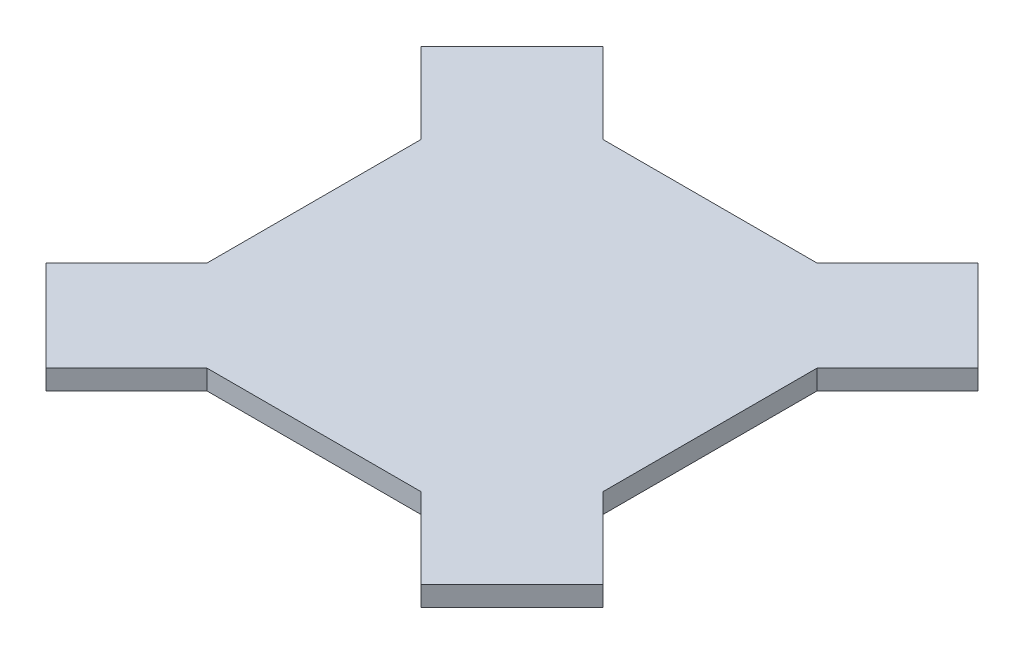
ISO-10303-21;
HEADER;
FILE_DESCRIPTION(('STEP AP214'),'2;1');
FILE_NAME('part.step','',(''),(''),'','','');
FILE_SCHEMA(('AUTOMOTIVE_DESIGN { 1 0 10303 214 1 1 1 1 }'));
ENDSEC;
DATA;
#1=APPLICATION_CONTEXT('core data for automotive mechanical design processes');
#2=APPLICATION_PROTOCOL_DEFINITION('international standard','automotive_design',2000,#1);
#3=PRODUCT_CONTEXT('',#1,'mechanical');
#4=PRODUCT('Part','Part','',(#3));
#5=PRODUCT_RELATED_PRODUCT_CATEGORY('part','',(#4));
#6=PRODUCT_DEFINITION_FORMATION('','',#4);
#7=PRODUCT_DEFINITION_CONTEXT('part definition',#1,'design');
#8=PRODUCT_DEFINITION('design','',#6,#7);
#9=PRODUCT_DEFINITION_SHAPE('','',#8);
#10=(LENGTH_UNIT() NAMED_UNIT(*) SI_UNIT(.MILLI.,.METRE.));
#11=(NAMED_UNIT(*) PLANE_ANGLE_UNIT() SI_UNIT($,.RADIAN.));
#12=(NAMED_UNIT(*) SI_UNIT($,.STERADIAN.) SOLID_ANGLE_UNIT());
#13=UNCERTAINTY_MEASURE_WITH_UNIT(LENGTH_MEASURE(1.E-05),#10,'distance_accuracy_value','');
#14=(GEOMETRIC_REPRESENTATION_CONTEXT(3) GLOBAL_UNCERTAINTY_ASSIGNED_CONTEXT((#13)) GLOBAL_UNIT_ASSIGNED_CONTEXT((#10,
#11,#12)) REPRESENTATION_CONTEXT('',''));
#15=CARTESIAN_POINT('',(0.,0.,0.));
#16=DIRECTION('',(0.,0.,1.));
#17=DIRECTION('',(1.,0.,0.));
#18=AXIS2_PLACEMENT_3D('',#15,#16,#17);
#19=CARTESIAN_POINT('',(-40.,4.,40.));
#20=DIRECTION('',(0.,0.,-1.));
#21=DIRECTION('',(-1.,0.,0.));
#22=AXIS2_PLACEMENT_3D('',#19,#20,#21);
#23=PLANE('',#22);
#24=DIRECTION('',(0.,1.,0.));
#25=VECTOR('',#24,1.);
#26=CARTESIAN_POINT('',(21.6152236891498,0.,40.));
#27=LINE('',#26,#25);
#28=CARTESIAN_POINT('',(21.6152236891498,0.,40.));
#29=VERTEX_POINT('',#28);
#30=CARTESIAN_POINT('',(21.6152236891498,4.,40.));
#31=VERTEX_POINT('',#30);
#32=EDGE_CURVE('E56',#29,#31,#27,.T.);
#33=ORIENTED_EDGE('',*,*,#32,.T.);
#34=DIRECTION('',(1.,0.,0.));
#35=VECTOR('',#34,1.);
#36=CARTESIAN_POINT('',(-40.,4.,40.));
#37=LINE('',#36,#35);
#38=CARTESIAN_POINT('',(-21.6152236891497,4.,40.));
#39=VERTEX_POINT('',#38);
#40=EDGE_CURVE('E11',#39,#31,#37,.T.);
#41=ORIENTED_EDGE('',*,*,#40,.F.);
#42=DIRECTION('',(0.,1.,0.));
#43=VECTOR('',#42,1.);
#44=CARTESIAN_POINT('',(-21.6152236891497,0.,40.));
#45=LINE('',#44,#43);
#46=CARTESIAN_POINT('',(-21.6152236891497,0.,40.));
#47=VERTEX_POINT('',#46);
#48=EDGE_CURVE('E236',#47,#39,#45,.T.);
#49=ORIENTED_EDGE('',*,*,#48,.F.);
#50=DIRECTION('',(1.,0.,0.));
#51=VECTOR('',#50,1.);
#52=CARTESIAN_POINT('',(-40.,0.,40.));
#53=LINE('',#52,#51);
#54=EDGE_CURVE('E43',#47,#29,#53,.T.);
#55=ORIENTED_EDGE('',*,*,#54,.T.);
#56=EDGE_LOOP('',(#33,#41,#49,#55));
#57=FACE_BOUND('',#56,.T.);
#58=ADVANCED_FACE('F39',(#57),#23,.F.);
#59=CARTESIAN_POINT('',(-40.,4.,-40.));
#60=DIRECTION('',(0.,0.,1.));
#61=DIRECTION('',(1.,0.,0.));
#62=AXIS2_PLACEMENT_3D('',#59,#60,#61);
#63=PLANE('',#62);
#64=DIRECTION('',(0.,1.,0.));
#65=VECTOR('',#64,1.);
#66=CARTESIAN_POINT('',(21.6152236891498,0.,-40.));
#67=LINE('',#66,#65);
#68=CARTESIAN_POINT('',(21.6152236891498,0.,-40.));
#69=VERTEX_POINT('',#68);
#70=CARTESIAN_POINT('',(21.6152236891498,4.,-40.));
#71=VERTEX_POINT('',#70);
#72=EDGE_CURVE('E200',#69,#71,#67,.T.);
#73=ORIENTED_EDGE('',*,*,#72,.F.);
#74=DIRECTION('',(-1.,0.,0.));
#75=VECTOR('',#74,1.);
#76=CARTESIAN_POINT('',(-40.,0.,-40.));
#77=LINE('',#76,#75);
#78=CARTESIAN_POINT('',(-21.6152236891497,0.,-40.));
#79=VERTEX_POINT('',#78);
#80=EDGE_CURVE('E274',#69,#79,#77,.T.);
#81=ORIENTED_EDGE('',*,*,#80,.T.);
#82=DIRECTION('',(0.,1.,0.));
#83=VECTOR('',#82,1.);
#84=CARTESIAN_POINT('',(-21.6152236891497,0.,-40.));
#85=LINE('',#84,#83);
#86=CARTESIAN_POINT('',(-21.6152236891497,4.,-40.));
#87=VERTEX_POINT('',#86);
#88=EDGE_CURVE('E251',#79,#87,#85,.T.);
#89=ORIENTED_EDGE('',*,*,#88,.T.);
#90=DIRECTION('',(-1.,0.,0.));
#91=VECTOR('',#90,1.);
#92=CARTESIAN_POINT('',(-40.,4.,-40.));
#93=LINE('',#92,#91);
#94=EDGE_CURVE('E269',#71,#87,#93,.T.);
#95=ORIENTED_EDGE('',*,*,#94,.F.);
#96=EDGE_LOOP('',(#73,#81,#89,#95));
#97=FACE_BOUND('',#96,.T.);
#98=ADVANCED_FACE('F316',(#97),#63,.F.);
#99=CARTESIAN_POINT('',(-40.,4.,40.));
#100=DIRECTION('',(1.,0.,0.));
#101=DIRECTION('',(0.,0.,-1.));
#102=AXIS2_PLACEMENT_3D('',#99,#100,#101);
#103=PLANE('',#102);
#104=DIRECTION('',(0.,1.,0.));
#105=VECTOR('',#104,1.);
#106=CARTESIAN_POINT('',(-40.,0.,21.6152236891499));
#107=LINE('',#106,#105);
#108=CARTESIAN_POINT('',(-40.,0.,21.6152236891499));
#109=VERTEX_POINT('',#108);
#110=CARTESIAN_POINT('',(-40.,4.,21.6152236891499));
#111=VERTEX_POINT('',#110);
#112=EDGE_CURVE('E233',#109,#111,#107,.T.);
#113=ORIENTED_EDGE('',*,*,#112,.T.);
#114=DIRECTION('',(0.,0.,1.));
#115=VECTOR('',#114,1.);
#116=CARTESIAN_POINT('',(-40.,4.,40.));
#117=LINE('',#116,#115);
#118=CARTESIAN_POINT('',(-40.,4.,-21.6152236891498));
#119=VERTEX_POINT('',#118);
#120=EDGE_CURVE('E48',#119,#111,#117,.T.);
#121=ORIENTED_EDGE('',*,*,#120,.F.);
#122=DIRECTION('',(0.,1.,0.));
#123=VECTOR('',#122,1.);
#124=CARTESIAN_POINT('',(-40.,0.,-21.6152236891498));
#125=LINE('',#124,#123);
#126=CARTESIAN_POINT('',(-40.,0.,-21.6152236891498));
#127=VERTEX_POINT('',#126);
#128=EDGE_CURVE('E258',#127,#119,#125,.T.);
#129=ORIENTED_EDGE('',*,*,#128,.F.);
#130=DIRECTION('',(0.,0.,1.));
#131=VECTOR('',#130,1.);
#132=CARTESIAN_POINT('',(-40.,0.,40.));
#133=LINE('',#132,#131);
#134=EDGE_CURVE('E275',#127,#109,#133,.T.);
#135=ORIENTED_EDGE('',*,*,#134,.T.);
#136=EDGE_LOOP('',(#113,#121,#129,#135));
#137=FACE_BOUND('',#136,.T.);
#138=ADVANCED_FACE('F298',(#137),#103,.F.);
#139=CARTESIAN_POINT('',(40.,4.,40.));
#140=DIRECTION('',(-1.,0.,0.));
#141=DIRECTION('',(0.,0.,1.));
#142=AXIS2_PLACEMENT_3D('',#139,#140,#141);
#143=PLANE('',#142);
#144=DIRECTION('',(0.,0.,-1.));
#145=VECTOR('',#144,1.);
#146=CARTESIAN_POINT('',(40.,4.,40.));
#147=LINE('',#146,#145);
#148=CARTESIAN_POINT('',(40.,4.,21.6152236891497));
#149=VERTEX_POINT('',#148);
#150=CARTESIAN_POINT('',(40.,4.,-21.6152236891497));
#151=VERTEX_POINT('',#150);
#152=EDGE_CURVE('E63',#149,#151,#147,.T.);
#153=ORIENTED_EDGE('',*,*,#152,.F.);
#154=DIRECTION('',(0.,1.,0.));
#155=VECTOR('',#154,1.);
#156=CARTESIAN_POINT('',(40.,0.,21.6152236891497));
#157=LINE('',#156,#155);
#158=CARTESIAN_POINT('',(40.,0.,21.6152236891497));
#159=VERTEX_POINT('',#158);
#160=EDGE_CURVE('E164',#159,#149,#157,.T.);
#161=ORIENTED_EDGE('',*,*,#160,.F.);
#162=DIRECTION('',(0.,0.,-1.));
#163=VECTOR('',#162,1.);
#164=CARTESIAN_POINT('',(40.,0.,40.));
#165=LINE('',#164,#163);
#166=CARTESIAN_POINT('',(40.,0.,-21.6152236891497));
#167=VERTEX_POINT('',#166);
#168=EDGE_CURVE('E173',#159,#167,#165,.T.);
#169=ORIENTED_EDGE('',*,*,#168,.T.);
#170=DIRECTION('',(0.,1.,0.));
#171=VECTOR('',#170,1.);
#172=CARTESIAN_POINT('',(40.,0.,-21.6152236891497));
#173=LINE('',#172,#171);
#174=EDGE_CURVE('E213',#167,#151,#173,.T.);
#175=ORIENTED_EDGE('',*,*,#174,.T.);
#176=EDGE_LOOP('',(#153,#161,#169,#175));
#177=FACE_BOUND('',#176,.T.);
#178=ADVANCED_FACE('F41',(#177),#143,.F.);
#179=CARTESIAN_POINT('',(0.,4.,0.));
#180=DIRECTION('',(0.,-1.,0.));
#181=DIRECTION('',(0.,0.,-1.));
#182=AXIS2_PLACEMENT_3D('',#179,#180,#181);
#183=PLANE('',#182);
#184=ORIENTED_EDGE('',*,*,#40,.T.);
#185=DIRECTION('',(-0.707106781186548,0.,-0.707106781186547));
#186=VECTOR('',#185,1.);
#187=CARTESIAN_POINT('',(-9.19238815542509,4.,9.1923881554251));
#188=LINE('',#187,#186);
#189=CARTESIAN_POINT('',(37.8786796564404,4.,56.2634559672906));
#190=VERTEX_POINT('',#189);
#191=EDGE_CURVE('E178',#190,#31,#188,.T.);
#192=ORIENTED_EDGE('',*,*,#191,.F.);
#193=DIRECTION('',(0.707106781186547,0.,-0.707106781186548));
#194=VECTOR('',#193,1.);
#195=CARTESIAN_POINT('',(47.0710678118655,4.,47.0710678118655));
#196=LINE('',#195,#194);
#197=CARTESIAN_POINT('',(56.2634559672906,4.,37.8786796564403));
#198=VERTEX_POINT('',#197);
#199=EDGE_CURVE('E184',#190,#198,#196,.T.);
#200=ORIENTED_EDGE('',*,*,#199,.T.);
#201=DIRECTION('',(-0.707106781186548,0.,-0.707106781186547));
#202=VECTOR('',#201,1.);
#203=CARTESIAN_POINT('',(9.19238815542514,4.,-9.19238815542514));
#204=LINE('',#203,#202);
#205=EDGE_CURVE('E159',#198,#149,#204,.T.);
#206=ORIENTED_EDGE('',*,*,#205,.T.);
#207=ORIENTED_EDGE('',*,*,#152,.T.);
#208=DIRECTION('',(0.707106781186548,0.,-0.707106781186547));
#209=VECTOR('',#208,1.);
#210=CARTESIAN_POINT('',(9.19238815542516,4.,9.19238815542516));
#211=LINE('',#210,#209);
#212=CARTESIAN_POINT('',(56.2634559672906,4.,-37.8786796564403));
#213=VERTEX_POINT('',#212);
#214=EDGE_CURVE('E203',#151,#213,#211,.T.);
#215=ORIENTED_EDGE('',*,*,#214,.T.);
#216=DIRECTION('',(-0.707106781186548,0.,-0.707106781186547));
#217=VECTOR('',#216,1.);
#218=CARTESIAN_POINT('',(47.0710678118655,4.,-47.0710678118655));
#219=LINE('',#218,#217);
#220=CARTESIAN_POINT('',(37.8786796564404,4.,-56.2634559672905));
#221=VERTEX_POINT('',#220);
#222=EDGE_CURVE('E194',#213,#221,#219,.T.);
#223=ORIENTED_EDGE('',*,*,#222,.T.);
#224=DIRECTION('',(0.707106781186547,0.,-0.707106781186548));
#225=VECTOR('',#224,1.);
#226=CARTESIAN_POINT('',(-9.19238815542507,4.,-9.19238815542507));
#227=LINE('',#226,#225);
#228=EDGE_CURVE('E188',#71,#221,#227,.T.);
#229=ORIENTED_EDGE('',*,*,#228,.F.);
#230=ORIENTED_EDGE('',*,*,#94,.T.);
#231=DIRECTION('',(-0.707106781186548,0.,-0.707106781186547));
#232=VECTOR('',#231,1.);
#233=CARTESIAN_POINT('',(9.19238815542514,4.,-9.19238815542514));
#234=LINE('',#233,#232);
#235=CARTESIAN_POINT('',(-37.8786796564404,4.,-56.2634559672906));
#236=VERTEX_POINT('',#235);
#237=EDGE_CURVE('E235',#87,#236,#234,.T.);
#238=ORIENTED_EDGE('',*,*,#237,.T.);
#239=DIRECTION('',(0.707106781186548,0.,-0.707106781186548));
#240=VECTOR('',#239,1.);
#241=CARTESIAN_POINT('',(-47.0710678118655,4.,-47.0710678118655));
#242=LINE('',#241,#240);
#243=CARTESIAN_POINT('',(-56.2634559672906,4.,-37.8786796564404));
#244=VERTEX_POINT('',#243);
#245=EDGE_CURVE('E254',#244,#236,#242,.T.);
#246=ORIENTED_EDGE('',*,*,#245,.F.);
#247=DIRECTION('',(-0.707106781186548,0.,-0.707106781186547));
#248=VECTOR('',#247,1.);
#249=CARTESIAN_POINT('',(-9.19238815542509,4.,9.1923881554251));
#250=LINE('',#249,#248);
#251=EDGE_CURVE('E247',#119,#244,#250,.T.);
#252=ORIENTED_EDGE('',*,*,#251,.F.);
#253=ORIENTED_EDGE('',*,*,#120,.T.);
#254=DIRECTION('',(0.707106781186547,0.,-0.707106781186548));
#255=VECTOR('',#254,1.);
#256=CARTESIAN_POINT('',(-9.19238815542507,4.,-9.19238815542507));
#257=LINE('',#256,#255);
#258=CARTESIAN_POINT('',(-56.2634559672905,4.,37.8786796564404));
#259=VERTEX_POINT('',#258);
#260=EDGE_CURVE('E210',#259,#111,#257,.T.);
#261=ORIENTED_EDGE('',*,*,#260,.F.);
#262=DIRECTION('',(-0.707106781186548,0.,-0.707106781186547));
#263=VECTOR('',#262,1.);
#264=CARTESIAN_POINT('',(-47.0710678118655,4.,47.0710678118655));
#265=LINE('',#264,#263);
#266=CARTESIAN_POINT('',(-37.8786796564403,4.,56.2634559672906));
#267=VERTEX_POINT('',#266);
#268=EDGE_CURVE('E229',#267,#259,#265,.T.);
#269=ORIENTED_EDGE('',*,*,#268,.F.);
#270=DIRECTION('',(0.707106781186548,0.,-0.707106781186547));
#271=VECTOR('',#270,1.);
#272=CARTESIAN_POINT('',(9.19238815542516,4.,9.19238815542516));
#273=LINE('',#272,#271);
#274=EDGE_CURVE('E221',#267,#39,#273,.T.);
#275=ORIENTED_EDGE('',*,*,#274,.T.);
#276=EDGE_LOOP('',(#184,#192,#200,#206,#207,#215,#223,#229,#230,#238,#246,#252,#253,#261,#269,#275));
#277=FACE_BOUND('',#276,.T.);
#278=ADVANCED_FACE('F284',(#277),#183,.F.);
#279=CARTESIAN_POINT('',(0.,0.,0.));
#280=DIRECTION('',(0.,-1.,0.));
#281=DIRECTION('',(0.,0.,-1.));
#282=AXIS2_PLACEMENT_3D('',#279,#280,#281);
#283=PLANE('',#282);
#284=ORIENTED_EDGE('',*,*,#168,.F.);
#285=DIRECTION('',(-0.707106781186548,0.,-0.707106781186547));
#286=VECTOR('',#285,1.);
#287=CARTESIAN_POINT('',(9.19238815542514,0.,-9.19238815542514));
#288=LINE('',#287,#286);
#289=CARTESIAN_POINT('',(56.2634559672906,0.,37.8786796564403));
#290=VERTEX_POINT('',#289);
#291=EDGE_CURVE('E157',#290,#159,#288,.T.);
#292=ORIENTED_EDGE('',*,*,#291,.F.);
#293=DIRECTION('',(0.707106781186547,0.,-0.707106781186548));
#294=VECTOR('',#293,1.);
#295=CARTESIAN_POINT('',(47.0710678118655,0.,47.0710678118655));
#296=LINE('',#295,#294);
#297=CARTESIAN_POINT('',(37.8786796564404,0.,56.2634559672906));
#298=VERTEX_POINT('',#297);
#299=EDGE_CURVE('E171',#298,#290,#296,.T.);
#300=ORIENTED_EDGE('',*,*,#299,.F.);
#301=DIRECTION('',(-0.707106781186548,0.,-0.707106781186547));
#302=VECTOR('',#301,1.);
#303=CARTESIAN_POINT('',(-9.19238815542509,0.,9.1923881554251));
#304=LINE('',#303,#302);
#305=EDGE_CURVE('E165',#298,#29,#304,.T.);
#306=ORIENTED_EDGE('',*,*,#305,.T.);
#307=ORIENTED_EDGE('',*,*,#54,.F.);
#308=DIRECTION('',(0.707106781186548,0.,-0.707106781186547));
#309=VECTOR('',#308,1.);
#310=CARTESIAN_POINT('',(9.19238815542516,0.,9.19238815542516));
#311=LINE('',#310,#309);
#312=CARTESIAN_POINT('',(-37.8786796564403,0.,56.2634559672906));
#313=VERTEX_POINT('',#312);
#314=EDGE_CURVE('E223',#313,#47,#311,.T.);
#315=ORIENTED_EDGE('',*,*,#314,.F.);
#316=DIRECTION('',(-0.707106781186548,0.,-0.707106781186547));
#317=VECTOR('',#316,1.);
#318=CARTESIAN_POINT('',(-47.0710678118655,0.,47.0710678118655));
#319=LINE('',#318,#317);
#320=CARTESIAN_POINT('',(-56.2634559672905,0.,37.8786796564404));
#321=VERTEX_POINT('',#320);
#322=EDGE_CURVE('E220',#313,#321,#319,.T.);
#323=ORIENTED_EDGE('',*,*,#322,.T.);
#324=DIRECTION('',(0.707106781186547,0.,-0.707106781186548));
#325=VECTOR('',#324,1.);
#326=CARTESIAN_POINT('',(-9.19238815542507,0.,-9.19238815542507));
#327=LINE('',#326,#325);
#328=EDGE_CURVE('E217',#321,#109,#327,.T.);
#329=ORIENTED_EDGE('',*,*,#328,.T.);
#330=ORIENTED_EDGE('',*,*,#134,.F.);
#331=DIRECTION('',(-0.707106781186548,0.,-0.707106781186547));
#332=VECTOR('',#331,1.);
#333=CARTESIAN_POINT('',(-9.19238815542509,0.,9.1923881554251));
#334=LINE('',#333,#332);
#335=CARTESIAN_POINT('',(-56.2634559672906,0.,-37.8786796564404));
#336=VERTEX_POINT('',#335);
#337=EDGE_CURVE('E249',#127,#336,#334,.T.);
#338=ORIENTED_EDGE('',*,*,#337,.T.);
#339=DIRECTION('',(0.707106781186548,0.,-0.707106781186548));
#340=VECTOR('',#339,1.);
#341=CARTESIAN_POINT('',(-47.0710678118655,0.,-47.0710678118655));
#342=LINE('',#341,#340);
#343=CARTESIAN_POINT('',(-37.8786796564404,0.,-56.2634559672906));
#344=VERTEX_POINT('',#343);
#345=EDGE_CURVE('E246',#336,#344,#342,.T.);
#346=ORIENTED_EDGE('',*,*,#345,.T.);
#347=DIRECTION('',(-0.707106781186548,0.,-0.707106781186547));
#348=VECTOR('',#347,1.);
#349=CARTESIAN_POINT('',(9.19238815542514,0.,-9.19238815542514));
#350=LINE('',#349,#348);
#351=EDGE_CURVE('E243',#79,#344,#350,.T.);
#352=ORIENTED_EDGE('',*,*,#351,.F.);
#353=ORIENTED_EDGE('',*,*,#80,.F.);
#354=DIRECTION('',(0.707106781186547,0.,-0.707106781186548));
#355=VECTOR('',#354,1.);
#356=CARTESIAN_POINT('',(-9.19238815542507,0.,-9.19238815542507));
#357=LINE('',#356,#355);
#358=CARTESIAN_POINT('',(37.8786796564404,0.,-56.2634559672905));
#359=VERTEX_POINT('',#358);
#360=EDGE_CURVE('E191',#69,#359,#357,.T.);
#361=ORIENTED_EDGE('',*,*,#360,.T.);
#362=DIRECTION('',(-0.707106781186548,0.,-0.707106781186547));
#363=VECTOR('',#362,1.);
#364=CARTESIAN_POINT('',(47.0710678118655,0.,-47.0710678118655));
#365=LINE('',#364,#363);
#366=CARTESIAN_POINT('',(56.2634559672906,0.,-37.8786796564403));
#367=VERTEX_POINT('',#366);
#368=EDGE_CURVE('E197',#367,#359,#365,.T.);
#369=ORIENTED_EDGE('',*,*,#368,.F.);
#370=DIRECTION('',(0.707106781186548,0.,-0.707106781186547));
#371=VECTOR('',#370,1.);
#372=CARTESIAN_POINT('',(9.19238815542516,0.,9.19238815542516));
#373=LINE('',#372,#371);
#374=EDGE_CURVE('E193',#167,#367,#373,.T.);
#375=ORIENTED_EDGE('',*,*,#374,.F.);
#376=EDGE_LOOP('',(#284,#292,#300,#306,#307,#315,#323,#329,#330,#338,#346,#352,#353,#361,#369,#375));
#377=FACE_BOUND('',#376,.T.);
#378=ADVANCED_FACE('F169',(#377),#283,.T.);
#379=CARTESIAN_POINT('',(-9.19238815542509,0.,9.1923881554251));
#380=DIRECTION('',(0.707106781186547,0.,-0.707106781186548));
#381=DIRECTION('',(-0.707106781186548,0.,-0.707106781186547));
#382=AXIS2_PLACEMENT_3D('',#379,#380,#381);
#383=PLANE('',#382);
#384=ORIENTED_EDGE('',*,*,#251,.T.);
#385=DIRECTION('',(0.,1.,0.));
#386=VECTOR('',#385,1.);
#387=CARTESIAN_POINT('',(-56.2634559672906,0.,-37.8786796564404));
#388=LINE('',#387,#386);
#389=EDGE_CURVE('E261',#336,#244,#388,.T.);
#390=ORIENTED_EDGE('',*,*,#389,.F.);
#391=ORIENTED_EDGE('',*,*,#337,.F.);
#392=ORIENTED_EDGE('',*,*,#128,.T.);
#393=EDGE_LOOP('',(#384,#390,#391,#392));
#394=FACE_BOUND('',#393,.T.);
#395=ADVANCED_FACE('F303',(#394),#383,.F.);
#396=CARTESIAN_POINT('',(-47.0710678118655,0.,-47.0710678118655));
#397=DIRECTION('',(0.707106781186547,0.,0.707106781186547));
#398=DIRECTION('',(0.707106781186548,0.,-0.707106781186548));
#399=AXIS2_PLACEMENT_3D('',#396,#397,#398);
#400=PLANE('',#399);
#401=ORIENTED_EDGE('',*,*,#245,.T.);
#402=DIRECTION('',(0.,1.,0.));
#403=VECTOR('',#402,1.);
#404=CARTESIAN_POINT('',(-37.8786796564404,0.,-56.2634559672906));
#405=LINE('',#404,#403);
#406=EDGE_CURVE('E264',#344,#236,#405,.T.);
#407=ORIENTED_EDGE('',*,*,#406,.F.);
#408=ORIENTED_EDGE('',*,*,#345,.F.);
#409=ORIENTED_EDGE('',*,*,#389,.T.);
#410=EDGE_LOOP('',(#401,#407,#408,#409));
#411=FACE_BOUND('',#410,.T.);
#412=ADVANCED_FACE('F307',(#411),#400,.F.);
#413=CARTESIAN_POINT('',(9.19238815542514,0.,-9.19238815542514));
#414=DIRECTION('',(0.707106781186547,0.,-0.707106781186548));
#415=DIRECTION('',(-0.707106781186548,0.,-0.707106781186547));
#416=AXIS2_PLACEMENT_3D('',#413,#414,#415);
#417=PLANE('',#416);
#418=ORIENTED_EDGE('',*,*,#237,.F.);
#419=ORIENTED_EDGE('',*,*,#88,.F.);
#420=ORIENTED_EDGE('',*,*,#351,.T.);
#421=ORIENTED_EDGE('',*,*,#406,.T.);
#422=EDGE_LOOP('',(#418,#419,#420,#421));
#423=FACE_BOUND('',#422,.T.);
#424=ADVANCED_FACE('F314',(#423),#417,.T.);
#425=CARTESIAN_POINT('',(-9.19238815542507,0.,-9.19238815542507));
#426=DIRECTION('',(0.707106781186548,0.,0.707106781186547));
#427=DIRECTION('',(0.707106781186547,0.,-0.707106781186548));
#428=AXIS2_PLACEMENT_3D('',#425,#426,#427);
#429=PLANE('',#428);
#430=ORIENTED_EDGE('',*,*,#260,.T.);
#431=ORIENTED_EDGE('',*,*,#112,.F.);
#432=ORIENTED_EDGE('',*,*,#328,.F.);
#433=DIRECTION('',(0.,1.,0.));
#434=VECTOR('',#433,1.);
#435=CARTESIAN_POINT('',(-56.2634559672905,0.,37.8786796564404));
#436=LINE('',#435,#434);
#437=EDGE_CURVE('E226',#321,#259,#436,.T.);
#438=ORIENTED_EDGE('',*,*,#437,.T.);
#439=EDGE_LOOP('',(#430,#431,#432,#438));
#440=FACE_BOUND('',#439,.T.);
#441=ADVANCED_FACE('F297',(#440),#429,.F.);
#442=CARTESIAN_POINT('',(9.19238815542516,0.,9.19238815542516));
#443=DIRECTION('',(0.707106781186547,0.,0.707106781186548));
#444=DIRECTION('',(0.707106781186548,0.,-0.707106781186547));
#445=AXIS2_PLACEMENT_3D('',#442,#443,#444);
#446=PLANE('',#445);
#447=ORIENTED_EDGE('',*,*,#274,.F.);
#448=DIRECTION('',(0.,1.,0.));
#449=VECTOR('',#448,1.);
#450=CARTESIAN_POINT('',(-37.8786796564403,0.,56.2634559672906));
#451=LINE('',#450,#449);
#452=EDGE_CURVE('E239',#313,#267,#451,.T.);
#453=ORIENTED_EDGE('',*,*,#452,.F.);
#454=ORIENTED_EDGE('',*,*,#314,.T.);
#455=ORIENTED_EDGE('',*,*,#48,.T.);
#456=EDGE_LOOP('',(#447,#453,#454,#455));
#457=FACE_BOUND('',#456,.T.);
#458=ADVANCED_FACE('F288',(#457),#446,.T.);
#459=CARTESIAN_POINT('',(-47.0710678118655,0.,47.0710678118655));
#460=DIRECTION('',(0.707106781186547,0.,-0.707106781186548));
#461=DIRECTION('',(-0.707106781186548,0.,-0.707106781186547));
#462=AXIS2_PLACEMENT_3D('',#459,#460,#461);
#463=PLANE('',#462);
#464=ORIENTED_EDGE('',*,*,#268,.T.);
#465=ORIENTED_EDGE('',*,*,#437,.F.);
#466=ORIENTED_EDGE('',*,*,#322,.F.);
#467=ORIENTED_EDGE('',*,*,#452,.T.);
#468=EDGE_LOOP('',(#464,#465,#466,#467));
#469=FACE_BOUND('',#468,.T.);
#470=ADVANCED_FACE('F294',(#469),#463,.F.);
#471=CARTESIAN_POINT('',(-9.19238815542507,0.,-9.19238815542507));
#472=DIRECTION('',(0.707106781186548,0.,0.707106781186547));
#473=DIRECTION('',(0.707106781186547,0.,-0.707106781186548));
#474=AXIS2_PLACEMENT_3D('',#471,#472,#473);
#475=PLANE('',#474);
#476=ORIENTED_EDGE('',*,*,#228,.T.);
#477=DIRECTION('',(0.,1.,0.));
#478=VECTOR('',#477,1.);
#479=CARTESIAN_POINT('',(37.8786796564404,0.,-56.2634559672905));
#480=LINE('',#479,#478);
#481=EDGE_CURVE('E208',#359,#221,#480,.T.);
#482=ORIENTED_EDGE('',*,*,#481,.F.);
#483=ORIENTED_EDGE('',*,*,#360,.F.);
#484=ORIENTED_EDGE('',*,*,#72,.T.);
#485=EDGE_LOOP('',(#476,#482,#483,#484));
#486=FACE_BOUND('',#485,.T.);
#487=ADVANCED_FACE('F321',(#486),#475,.F.);
#488=CARTESIAN_POINT('',(47.0710678118655,0.,-47.0710678118655));
#489=DIRECTION('',(0.707106781186547,0.,-0.707106781186548));
#490=DIRECTION('',(-0.707106781186548,0.,-0.707106781186547));
#491=AXIS2_PLACEMENT_3D('',#488,#489,#490);
#492=PLANE('',#491);
#493=ORIENTED_EDGE('',*,*,#222,.F.);
#494=DIRECTION('',(0.,1.,0.));
#495=VECTOR('',#494,1.);
#496=CARTESIAN_POINT('',(56.2634559672906,0.,-37.8786796564403));
#497=LINE('',#496,#495);
#498=EDGE_CURVE('E211',#367,#213,#497,.T.);
#499=ORIENTED_EDGE('',*,*,#498,.F.);
#500=ORIENTED_EDGE('',*,*,#368,.T.);
#501=ORIENTED_EDGE('',*,*,#481,.T.);
#502=EDGE_LOOP('',(#493,#499,#500,#501));
#503=FACE_BOUND('',#502,.T.);
#504=ADVANCED_FACE('F325',(#503),#492,.T.);
#505=CARTESIAN_POINT('',(9.19238815542516,0.,9.19238815542516));
#506=DIRECTION('',(0.707106781186547,0.,0.707106781186548));
#507=DIRECTION('',(0.707106781186548,0.,-0.707106781186547));
#508=AXIS2_PLACEMENT_3D('',#505,#506,#507);
#509=PLANE('',#508);
#510=ORIENTED_EDGE('',*,*,#214,.F.);
#511=ORIENTED_EDGE('',*,*,#174,.F.);
#512=ORIENTED_EDGE('',*,*,#374,.T.);
#513=ORIENTED_EDGE('',*,*,#498,.T.);
#514=EDGE_LOOP('',(#510,#511,#512,#513));
#515=FACE_BOUND('',#514,.T.);
#516=ADVANCED_FACE('F329',(#515),#509,.T.);
#517=CARTESIAN_POINT('',(47.0710678118655,0.,47.0710678118655));
#518=DIRECTION('',(0.707106781186548,0.,0.707106781186547));
#519=DIRECTION('',(0.707106781186547,0.,-0.707106781186548));
#520=AXIS2_PLACEMENT_3D('',#517,#518,#519);
#521=PLANE('',#520);
#522=ORIENTED_EDGE('',*,*,#199,.F.);
#523=DIRECTION('',(0.,1.,0.));
#524=VECTOR('',#523,1.);
#525=CARTESIAN_POINT('',(37.8786796564404,0.,56.2634559672906));
#526=LINE('',#525,#524);
#527=EDGE_CURVE('E176',#298,#190,#526,.T.);
#528=ORIENTED_EDGE('',*,*,#527,.F.);
#529=ORIENTED_EDGE('',*,*,#299,.T.);
#530=DIRECTION('',(0.,1.,0.));
#531=VECTOR('',#530,1.);
#532=CARTESIAN_POINT('',(56.2634559672906,0.,37.8786796564403));
#533=LINE('',#532,#531);
#534=EDGE_CURVE('E154',#290,#198,#533,.T.);
#535=ORIENTED_EDGE('',*,*,#534,.T.);
#536=EDGE_LOOP('',(#522,#528,#529,#535));
#537=FACE_BOUND('',#536,.T.);
#538=ADVANCED_FACE('F175',(#537),#521,.T.);
#539=CARTESIAN_POINT('',(-9.19238815542509,0.,9.1923881554251));
#540=DIRECTION('',(0.707106781186547,0.,-0.707106781186548));
#541=DIRECTION('',(-0.707106781186548,0.,-0.707106781186547));
#542=AXIS2_PLACEMENT_3D('',#539,#540,#541);
#543=PLANE('',#542);
#544=ORIENTED_EDGE('',*,*,#191,.T.);
#545=ORIENTED_EDGE('',*,*,#32,.F.);
#546=ORIENTED_EDGE('',*,*,#305,.F.);
#547=ORIENTED_EDGE('',*,*,#527,.T.);
#548=EDGE_LOOP('',(#544,#545,#546,#547));
#549=FACE_BOUND('',#548,.T.);
#550=ADVANCED_FACE('F281',(#549),#543,.F.);
#551=CARTESIAN_POINT('',(9.19238815542514,0.,-9.19238815542514));
#552=DIRECTION('',(0.707106781186547,0.,-0.707106781186548));
#553=DIRECTION('',(-0.707106781186548,0.,-0.707106781186547));
#554=AXIS2_PLACEMENT_3D('',#551,#552,#553);
#555=PLANE('',#554);
#556=ORIENTED_EDGE('',*,*,#205,.F.);
#557=ORIENTED_EDGE('',*,*,#534,.F.);
#558=ORIENTED_EDGE('',*,*,#291,.T.);
#559=ORIENTED_EDGE('',*,*,#160,.T.);
#560=EDGE_LOOP('',(#556,#557,#558,#559));
#561=FACE_BOUND('',#560,.T.);
#562=ADVANCED_FACE('F156',(#561),#555,.T.);
#563=CLOSED_SHELL('',(#58,#98,#138,#178,#278,#378,#395,#412,#424,#441,#458,#470,#487,#504,#516,
#538,#550,#562));
#564=MANIFOLD_SOLID_BREP('B2',#563);
#565=ADVANCED_BREP_SHAPE_REPRESENTATION('',(#18,#564),#14);
#566=SHAPE_DEFINITION_REPRESENTATION(#9,#565);
ENDSEC;
END-ISO-10303-21;
